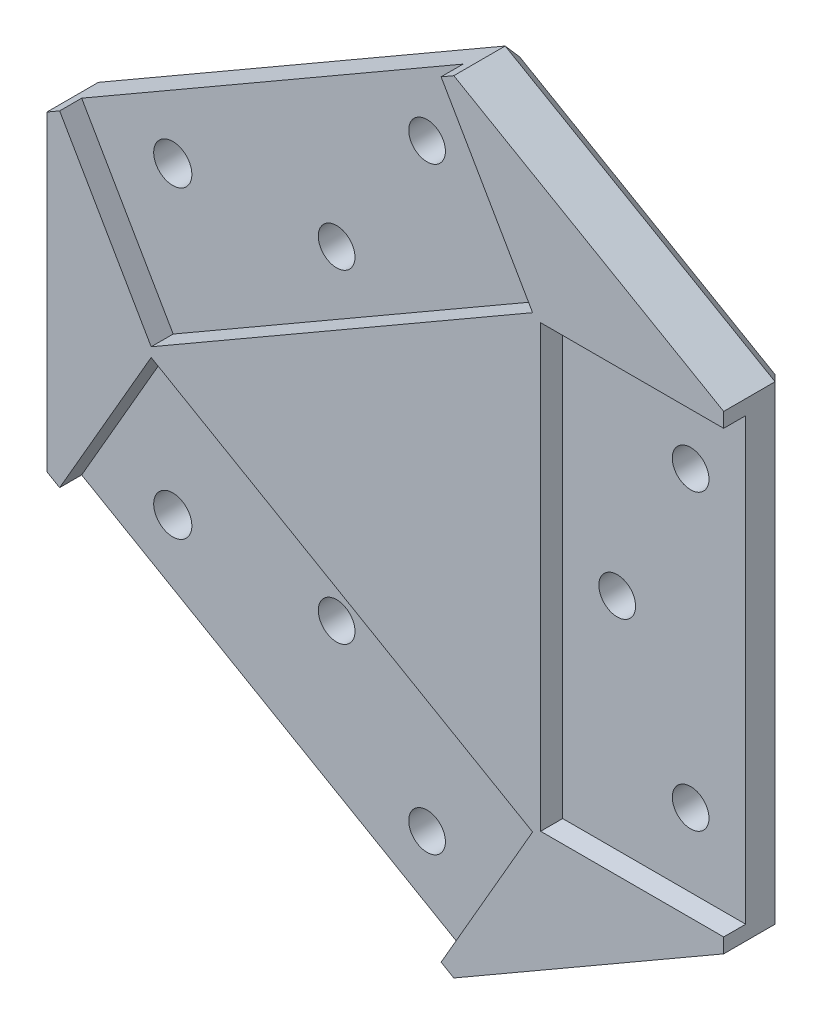
ISO-10303-21;
HEADER;
FILE_DESCRIPTION(('STEP AP214'),'2;1');
FILE_NAME('part.step','',(''),(''),'','','');
FILE_SCHEMA(('AUTOMOTIVE_DESIGN { 1 0 10303 214 1 1 1 1 }'));
ENDSEC;
DATA;
#1=APPLICATION_CONTEXT('core data for automotive mechanical design processes');
#2=APPLICATION_PROTOCOL_DEFINITION('international standard','automotive_design',2000,#1);
#3=PRODUCT_CONTEXT('',#1,'mechanical');
#4=PRODUCT('Part','Part','',(#3));
#5=PRODUCT_RELATED_PRODUCT_CATEGORY('part','',(#4));
#6=PRODUCT_DEFINITION_FORMATION('','',#4);
#7=PRODUCT_DEFINITION_CONTEXT('part definition',#1,'design');
#8=PRODUCT_DEFINITION('design','',#6,#7);
#9=PRODUCT_DEFINITION_SHAPE('','',#8);
#10=(LENGTH_UNIT() NAMED_UNIT(*) SI_UNIT(.MILLI.,.METRE.));
#11=(NAMED_UNIT(*) PLANE_ANGLE_UNIT() SI_UNIT($,.RADIAN.));
#12=(NAMED_UNIT(*) SI_UNIT($,.STERADIAN.) SOLID_ANGLE_UNIT());
#13=UNCERTAINTY_MEASURE_WITH_UNIT(LENGTH_MEASURE(1.E-05),#10,'distance_accuracy_value','');
#14=(GEOMETRIC_REPRESENTATION_CONTEXT(3) GLOBAL_UNCERTAINTY_ASSIGNED_CONTEXT((#13)) GLOBAL_UNIT_ASSIGNED_CONTEXT((#10,
#11,#12)) REPRESENTATION_CONTEXT('',''));
#15=CARTESIAN_POINT('',(0.,0.,0.));
#16=DIRECTION('',(0.,0.,1.));
#17=DIRECTION('',(1.,0.,0.));
#18=AXIS2_PLACEMENT_3D('',#15,#16,#17);
#19=CARTESIAN_POINT('',(2947.32445816177,821.633970520582,9.));
#20=DIRECTION('',(0.,0.,1.));
#21=DIRECTION('',(1.,0.,0.));
#22=AXIS2_PLACEMENT_3D('',#19,#20,#21);
#23=PLANE('',#22);
#24=DIRECTION('',(0.,-1.,0.));
#25=VECTOR('',#24,1.);
#26=CARTESIAN_POINT('',(2968.48484208918,821.633970520582,9.));
#27=LINE('',#26,#25);
#28=CARTESIAN_POINT('',(2968.48484208918,961.308381014684,9.));
#29=VERTEX_POINT('',#28);
#30=CARTESIAN_POINT('',(2968.48484208918,901.308381014683,9.));
#31=VERTEX_POINT('',#30);
#32=EDGE_CURVE('E217',#29,#31,#27,.T.);
#33=ORIENTED_EDGE('',*,*,#32,.F.);
#34=DIRECTION('',(1.,0.,0.));
#35=VECTOR('',#34,1.);
#36=CARTESIAN_POINT('',(2947.32445816177,961.308381014684,9.));
#37=LINE('',#36,#35);
#38=CARTESIAN_POINT('',(2993.41893222177,961.308381014684,9.));
#39=VERTEX_POINT('',#38);
#40=EDGE_CURVE('E187',#29,#39,#37,.T.);
#41=ORIENTED_EDGE('',*,*,#40,.T.);
#42=DIRECTION('',(0.,-1.,0.));
#43=VECTOR('',#42,1.);
#44=CARTESIAN_POINT('',(2993.41893222177,821.633970520584,9.));
#45=LINE('',#44,#43);
#46=CARTESIAN_POINT('',(2993.41893222177,963.308381014684,9.));
#47=VERTEX_POINT('',#46);
#48=EDGE_CURVE('E299',#47,#39,#45,.T.);
#49=ORIENTED_EDGE('',*,*,#48,.F.);
#50=DIRECTION('',(0.866025403784424,-0.500000000000026,0.));
#51=VECTOR('',#50,1.);
#52=CARTESIAN_POINT('',(3020.19489595381,947.849271146175,9.));
#53=LINE('',#52,#51);
#54=CARTESIAN_POINT('',(2956.65560994398,984.533695028071,9.));
#55=VERTEX_POINT('',#54);
#56=EDGE_CURVE('E302',#55,#47,#53,.T.);
#57=ORIENTED_EDGE('',*,*,#56,.F.);
#58=DIRECTION('',(0.866025403784453,0.499999999999975,0.));
#59=VECTOR('',#58,1.);
#60=CARTESIAN_POINT('',(2879.11959626084,939.768256656223,9.));
#61=LINE('',#60,#59);
#62=CARTESIAN_POINT('',(2954.92355913641,983.533695028071,9.));
#63=VERTEX_POINT('',#62);
#64=EDGE_CURVE('E306',#63,#55,#61,.T.);
#65=ORIENTED_EDGE('',*,*,#64,.F.);
#66=DIRECTION('',(-0.499999999999997,0.866025403784441,0.));
#67=VECTOR('',#66,1.);
#68=CARTESIAN_POINT('',(3023.12842103735,865.399408892434,9.));
#69=LINE('',#68,#67);
#70=CARTESIAN_POINT('',(2967.39060420271,961.940139552993,9.));
#71=VERTEX_POINT('',#70);
#72=EDGE_CURVE('E248',#71,#63,#69,.T.);
#73=ORIENTED_EDGE('',*,*,#72,.F.);
#74=DIRECTION('',(-0.866025403784429,-0.500000000000017,0.));
#75=VECTOR('',#74,1.);
#76=CARTESIAN_POINT('',(2891.58664132714,918.174701181138,9.));
#77=LINE('',#76,#75);
#78=CARTESIAN_POINT('',(2915.42907997564,931.940139552992,9.));
#79=VERTEX_POINT('',#78);
#80=EDGE_CURVE('E222',#71,#79,#77,.T.);
#81=ORIENTED_EDGE('',*,*,#80,.T.);
#82=DIRECTION('',(-0.50000000000001,0.866025403784433,0.));
#83=VECTOR('',#82,1.);
#84=CARTESIAN_POINT('',(2971.16689681028,835.399408892435,9.));
#85=LINE('',#84,#83);
#86=CARTESIAN_POINT('',(2902.96203490935,953.533695028073,9.));
#87=VERTEX_POINT('',#86);
#88=EDGE_CURVE('E231',#79,#87,#85,.T.);
#89=ORIENTED_EDGE('',*,*,#88,.T.);
#90=CARTESIAN_POINT('',(2901.22998410178,952.533695028074,9.));
#91=VERTEX_POINT('',#90);
#92=EDGE_CURVE('E307',#91,#87,#61,.T.);
#93=ORIENTED_EDGE('',*,*,#92,.F.);
#94=DIRECTION('',(0.,1.,0.));
#95=VECTOR('',#94,1.);
#96=CARTESIAN_POINT('',(2901.22998410177,821.633970520584,9.));
#97=LINE('',#96,#95);
#98=CARTESIAN_POINT('',(2901.22998410178,910.083067001311,9.));
#99=VERTEX_POINT('',#98);
#100=EDGE_CURVE('E310',#99,#91,#97,.T.);
#101=ORIENTED_EDGE('',*,*,#100,.F.);
#102=DIRECTION('',(0.866025403784218,-0.500000000000382,0.));
#103=VECTOR('',#102,1.);
#104=CARTESIAN_POINT('',(2974.10042189382,868.011300126065,9.));
#105=LINE('',#104,#103);
#106=CARTESIAN_POINT('',(2902.96203490935,909.083067001307,9.));
#107=VERTEX_POINT('',#106);
#108=EDGE_CURVE('E314',#99,#107,#105,.T.);
#109=ORIENTED_EDGE('',*,*,#108,.T.);
#110=DIRECTION('',(-0.500000000000018,-0.866025403784428,0.));
#111=VECTOR('',#110,1.);
#112=CARTESIAN_POINT('',(2876.18607117731,862.705737395783,9.));
#113=LINE('',#112,#111);
#114=CARTESIAN_POINT('',(2915.42907997564,930.676622476375,9.));
#115=VERTEX_POINT('',#114);
#116=EDGE_CURVE('E285',#115,#107,#113,.T.);
#117=ORIENTED_EDGE('',*,*,#116,.F.);
#118=DIRECTION('',(-0.866025403784444,0.499999999999991,0.));
#119=VECTOR('',#118,1.);
#120=CARTESIAN_POINT('',(2986.56746696011,889.604855601177,9.));
#121=LINE('',#120,#119);
#122=CARTESIAN_POINT('',(2967.39060420271,900.676622476375,9.));
#123=VERTEX_POINT('',#122);
#124=EDGE_CURVE('E255',#123,#115,#121,.T.);
#125=ORIENTED_EDGE('',*,*,#124,.F.);
#126=DIRECTION('',(-0.499999999999998,-0.86602540378444,0.));
#127=VECTOR('',#126,1.);
#128=CARTESIAN_POINT('',(2928.14759540437,832.70573739578,9.));
#129=LINE('',#128,#127);
#130=CARTESIAN_POINT('',(2954.92355913641,879.083067001283,9.));
#131=VERTEX_POINT('',#130);
#132=EDGE_CURVE('E266',#123,#131,#129,.T.);
#133=ORIENTED_EDGE('',*,*,#132,.T.);
#134=CARTESIAN_POINT('',(2956.65560994397,878.083067001287,9.));
#135=VERTEX_POINT('',#134);
#136=EDGE_CURVE('E313',#131,#135,#105,.T.);
#137=ORIENTED_EDGE('',*,*,#136,.T.);
#138=DIRECTION('',(0.866025403784429,0.500000000000018,0.));
#139=VECTOR('',#138,1.);
#140=CARTESIAN_POINT('',(2925.21407032084,859.930285636136,9.));
#141=LINE('',#140,#139);
#142=CARTESIAN_POINT('',(2993.41893222177,899.308381014684,9.));
#143=VERTEX_POINT('',#142);
#144=EDGE_CURVE('E317',#135,#143,#141,.T.);
#145=ORIENTED_EDGE('',*,*,#144,.T.);
#146=CARTESIAN_POINT('',(2993.41893222177,901.308381014683,9.));
#147=VERTEX_POINT('',#146);
#148=EDGE_CURVE('E303',#147,#143,#45,.T.);
#149=ORIENTED_EDGE('',*,*,#148,.F.);
#150=DIRECTION('',(1.,0.,0.));
#151=VECTOR('',#150,1.);
#152=CARTESIAN_POINT('',(2947.32445816177,901.308381014683,9.));
#153=LINE('',#152,#151);
#154=EDGE_CURVE('E201',#31,#147,#153,.T.);
#155=ORIENTED_EDGE('',*,*,#154,.F.);
#156=EDGE_LOOP('',(#33,#41,#49,#57,#65,#73,#81,#89,#93,#101,#109,#117,#125,#133,#137,#145,#149,#155));
#157=FACE_BOUND('',#156,.T.);
#158=ADVANCED_FACE('F35',(#157),#23,.T.);
#159=CARTESIAN_POINT('',(2993.41893222177,821.633970520584,9.));
#160=DIRECTION('',(1.,0.,0.));
#161=DIRECTION('',(0.,1.,0.));
#162=AXIS2_PLACEMENT_3D('',#159,#160,#161);
#163=PLANE('',#162);
#164=ORIENTED_EDGE('',*,*,#48,.T.);
#165=DIRECTION('',(0.,0.,1.));
#166=VECTOR('',#165,1.);
#167=CARTESIAN_POINT('',(2993.41893222177,961.308381014684,6.));
#168=LINE('',#167,#166);
#169=CARTESIAN_POINT('',(2993.41893222177,961.308381014684,6.));
#170=VERTEX_POINT('',#169);
#171=EDGE_CURVE('E220',#170,#39,#168,.T.);
#172=ORIENTED_EDGE('',*,*,#171,.F.);
#173=DIRECTION('',(0.,1.,0.));
#174=VECTOR('',#173,1.);
#175=CARTESIAN_POINT('',(2993.41893222177,821.633970520583,6.));
#176=LINE('',#175,#174);
#177=CARTESIAN_POINT('',(2993.41893222177,901.308381014683,6.));
#178=VERTEX_POINT('',#177);
#179=EDGE_CURVE('E199',#178,#170,#176,.T.);
#180=ORIENTED_EDGE('',*,*,#179,.F.);
#181=DIRECTION('',(0.,0.,1.));
#182=VECTOR('',#181,1.);
#183=CARTESIAN_POINT('',(2993.41893222177,901.308381014683,6.));
#184=LINE('',#183,#182);
#185=EDGE_CURVE('E223',#178,#147,#184,.T.);
#186=ORIENTED_EDGE('',*,*,#185,.T.);
#187=ORIENTED_EDGE('',*,*,#148,.T.);
#188=DIRECTION('',(0.,0.,-1.));
#189=VECTOR('',#188,1.);
#190=CARTESIAN_POINT('',(2993.41893222177,899.308381014684,9.));
#191=LINE('',#190,#189);
#192=CARTESIAN_POINT('',(2993.41893222177,899.308381014684,2.00000000000003));
#193=VERTEX_POINT('',#192);
#194=EDGE_CURVE('E320',#143,#193,#191,.T.);
#195=ORIENTED_EDGE('',*,*,#194,.T.);
#196=DIRECTION('',(0.,1.,0.));
#197=VECTOR('',#196,1.);
#198=CARTESIAN_POINT('',(2993.41893222177,963.308381014684,2.00000000000003));
#199=LINE('',#198,#197);
#200=CARTESIAN_POINT('',(2993.41893222177,963.308381014684,2.00000000000003));
#201=VERTEX_POINT('',#200);
#202=EDGE_CURVE('E11',#193,#201,#199,.T.);
#203=ORIENTED_EDGE('',*,*,#202,.T.);
#204=DIRECTION('',(0.,0.,-1.));
#205=VECTOR('',#204,1.);
#206=CARTESIAN_POINT('',(2993.41893222177,963.308381014684,9.));
#207=LINE('',#206,#205);
#208=EDGE_CURVE('E362',#47,#201,#207,.T.);
#209=ORIENTED_EDGE('',*,*,#208,.F.);
#210=EDGE_LOOP('',(#164,#172,#180,#186,#187,#195,#203,#209));
#211=FACE_BOUND('',#210,.T.);
#212=ADVANCED_FACE('F476',(#211),#163,.T.);
#213=CARTESIAN_POINT('',(2985.91893222177,951.308381014684,9.));
#214=DIRECTION('',(0.,0.,-1.));
#215=DIRECTION('',(-1.,0.,0.));
#216=AXIS2_PLACEMENT_3D('',#213,#214,#215);
#217=CYLINDRICAL_SURFACE('',#216,2.49999999999995);
#218=CARTESIAN_POINT('',(2985.91893222177,951.308381014684,0.));
#219=DIRECTION('',(0.,0.,1.));
#220=DIRECTION('',(1.,0.,0.));
#221=AXIS2_PLACEMENT_3D('',#218,#219,#220);
#222=CIRCLE('',#221,2.49999999999995);
#223=CARTESIAN_POINT('',(2988.41893222177,951.308381014684,0.));
#224=VERTEX_POINT('',#223);
#225=EDGE_CURVE('E333',#224,#224,#222,.T.);
#226=ORIENTED_EDGE('',*,*,#225,.F.);
#227=EDGE_LOOP('',(#226));
#228=FACE_BOUND('',#227,.T.);
#229=CARTESIAN_POINT('',(2985.91893222177,951.308381014684,6.));
#230=DIRECTION('',(0.,0.,1.));
#231=DIRECTION('',(1.,0.,0.));
#232=AXIS2_PLACEMENT_3D('',#229,#230,#231);
#233=CIRCLE('',#232,2.49999999999995);
#234=CARTESIAN_POINT('',(2988.41893222177,951.308381014684,6.));
#235=VERTEX_POINT('',#234);
#236=EDGE_CURVE('E208',#235,#235,#233,.F.);
#237=ORIENTED_EDGE('',*,*,#236,.F.);
#238=EDGE_LOOP('',(#237));
#239=FACE_BOUND('',#238,.T.);
#240=ADVANCED_FACE('F481',(#228,#239),#217,.F.);
#241=CARTESIAN_POINT('',(2985.91893222177,911.308381014684,9.));
#242=DIRECTION('',(0.,0.,-1.));
#243=DIRECTION('',(-1.,0.,0.));
#244=AXIS2_PLACEMENT_3D('',#241,#242,#243);
#245=CYLINDRICAL_SURFACE('',#244,2.49999999999995);
#246=CARTESIAN_POINT('',(2985.91893222177,911.308381014684,0.));
#247=DIRECTION('',(0.,0.,1.));
#248=DIRECTION('',(1.,0.,0.));
#249=AXIS2_PLACEMENT_3D('',#246,#247,#248);
#250=CIRCLE('',#249,2.49999999999995);
#251=CARTESIAN_POINT('',(2988.41893222177,911.308381014684,0.));
#252=VERTEX_POINT('',#251);
#253=EDGE_CURVE('E330',#252,#252,#250,.T.);
#254=ORIENTED_EDGE('',*,*,#253,.F.);
#255=EDGE_LOOP('',(#254));
#256=FACE_BOUND('',#255,.T.);
#257=CARTESIAN_POINT('',(2985.91893222177,911.308381014684,6.));
#258=DIRECTION('',(0.,0.,1.));
#259=DIRECTION('',(1.,0.,0.));
#260=AXIS2_PLACEMENT_3D('',#257,#258,#259);
#261=CIRCLE('',#260,2.49999999999995);
#262=CARTESIAN_POINT('',(2988.41893222177,911.308381014684,6.));
#263=VERTEX_POINT('',#262);
#264=EDGE_CURVE('E193',#263,#263,#261,.F.);
#265=ORIENTED_EDGE('',*,*,#264,.F.);
#266=EDGE_LOOP('',(#265));
#267=FACE_BOUND('',#266,.T.);
#268=ADVANCED_FACE('F493',(#256,#267),#245,.F.);
#269=CARTESIAN_POINT('',(2975.91893222177,931.308381014684,9.));
#270=DIRECTION('',(0.,0.,-1.));
#271=DIRECTION('',(-1.,0.,0.));
#272=AXIS2_PLACEMENT_3D('',#269,#270,#271);
#273=CYLINDRICAL_SURFACE('',#272,2.49999999999995);
#274=CARTESIAN_POINT('',(2975.91893222177,931.308381014684,0.));
#275=DIRECTION('',(0.,0.,1.));
#276=DIRECTION('',(1.,0.,0.));
#277=AXIS2_PLACEMENT_3D('',#274,#275,#276);
#278=CIRCLE('',#277,2.49999999999995);
#279=CARTESIAN_POINT('',(2978.41893222177,931.308381014684,0.));
#280=VERTEX_POINT('',#279);
#281=EDGE_CURVE('E345',#280,#280,#278,.T.);
#282=ORIENTED_EDGE('',*,*,#281,.F.);
#283=EDGE_LOOP('',(#282));
#284=FACE_BOUND('',#283,.T.);
#285=CARTESIAN_POINT('',(2975.91893222177,931.308381014684,6.));
#286=DIRECTION('',(0.,0.,1.));
#287=DIRECTION('',(1.,0.,0.));
#288=AXIS2_PLACEMENT_3D('',#285,#286,#287);
#289=CIRCLE('',#288,2.49999999999995);
#290=CARTESIAN_POINT('',(2978.41893222177,931.308381014684,6.));
#291=VERTEX_POINT('',#290);
#292=EDGE_CURVE('E211',#291,#291,#289,.F.);
#293=ORIENTED_EDGE('',*,*,#292,.F.);
#294=EDGE_LOOP('',(#293));
#295=FACE_BOUND('',#294,.T.);
#296=ADVANCED_FACE('F490',(#284,#295),#273,.F.);
#297=CARTESIAN_POINT('',(2879.11959626084,939.768256656223,9.));
#298=DIRECTION('',(-0.499999999999975,0.866025403784453,0.));
#299=DIRECTION('',(-0.866025403784453,-0.499999999999975,0.));
#300=AXIS2_PLACEMENT_3D('',#297,#298,#299);
#301=PLANE('',#300);
#302=ORIENTED_EDGE('',*,*,#92,.T.);
#303=DIRECTION('',(0.,0.,1.));
#304=VECTOR('',#303,1.);
#305=CARTESIAN_POINT('',(2902.96203490935,953.533695028073,6.));
#306=LINE('',#305,#304);
#307=CARTESIAN_POINT('',(2902.96203490935,953.533695028073,6.));
#308=VERTEX_POINT('',#307);
#309=EDGE_CURVE('E256',#308,#87,#306,.T.);
#310=ORIENTED_EDGE('',*,*,#309,.F.);
#311=DIRECTION('',(-0.866025403784453,-0.499999999999975,0.));
#312=VECTOR('',#311,1.);
#313=CARTESIAN_POINT('',(2879.11959626084,939.768256656223,6.));
#314=LINE('',#313,#312);
#315=CARTESIAN_POINT('',(2954.92355913641,983.533695028071,6.));
#316=VERTEX_POINT('',#315);
#317=EDGE_CURVE('E241',#316,#308,#314,.T.);
#318=ORIENTED_EDGE('',*,*,#317,.F.);
#319=DIRECTION('',(0.,0.,1.));
#320=VECTOR('',#319,1.);
#321=CARTESIAN_POINT('',(2954.92355913641,983.533695028071,6.));
#322=LINE('',#321,#320);
#323=EDGE_CURVE('E258',#316,#63,#322,.T.);
#324=ORIENTED_EDGE('',*,*,#323,.T.);
#325=ORIENTED_EDGE('',*,*,#64,.T.);
#326=DIRECTION('',(0.,0.,-1.));
#327=VECTOR('',#326,1.);
#328=CARTESIAN_POINT('',(2956.65560994398,984.533695028071,9.));
#329=LINE('',#328,#327);
#330=CARTESIAN_POINT('',(2956.65560994398,984.533695028071,2.00000000000003));
#331=VERTEX_POINT('',#330);
#332=EDGE_CURVE('E359',#55,#331,#329,.T.);
#333=ORIENTED_EDGE('',*,*,#332,.T.);
#334=DIRECTION('',(-0.866025403784453,-0.499999999999975,0.));
#335=VECTOR('',#334,1.);
#336=CARTESIAN_POINT('',(2901.22998410178,952.533695028074,2.00000000000003));
#337=LINE('',#336,#335);
#338=CARTESIAN_POINT('',(2901.22998410178,952.533695028074,2.00000000000003));
#339=VERTEX_POINT('',#338);
#340=EDGE_CURVE('E381',#331,#339,#337,.T.);
#341=ORIENTED_EDGE('',*,*,#340,.T.);
#342=DIRECTION('',(0.,0.,-1.));
#343=VECTOR('',#342,1.);
#344=CARTESIAN_POINT('',(2901.22998410178,952.533695028074,9.));
#345=LINE('',#344,#343);
#346=EDGE_CURVE('E356',#91,#339,#345,.T.);
#347=ORIENTED_EDGE('',*,*,#346,.F.);
#348=EDGE_LOOP('',(#302,#310,#318,#324,#325,#333,#341,#347));
#349=FACE_BOUND('',#348,.T.);
#350=ADVANCED_FACE('F443',(#349),#301,.T.);
#351=CARTESIAN_POINT('',(2950.01330509856,972.038504499697,9.));
#352=DIRECTION('',(0.,0.,-1.));
#353=DIRECTION('',(-1.,0.,0.));
#354=AXIS2_PLACEMENT_3D('',#351,#352,#353);
#355=CYLINDRICAL_SURFACE('',#354,2.49999999999995);
#356=CARTESIAN_POINT('',(2950.01330509856,972.038504499697,0.));
#357=DIRECTION('',(0.,0.,1.));
#358=DIRECTION('',(1.,0.,0.));
#359=AXIS2_PLACEMENT_3D('',#356,#357,#358);
#360=CIRCLE('',#359,2.49999999999995);
#361=CARTESIAN_POINT('',(2952.51330509856,972.038504499697,0.));
#362=VERTEX_POINT('',#361);
#363=EDGE_CURVE('E342',#362,#362,#360,.T.);
#364=ORIENTED_EDGE('',*,*,#363,.F.);
#365=EDGE_LOOP('',(#364));
#366=FACE_BOUND('',#365,.T.);
#367=CARTESIAN_POINT('',(2950.01330509856,972.038504499697,6.));
#368=DIRECTION('',(0.,0.,1.));
#369=DIRECTION('',(1.,0.,0.));
#370=AXIS2_PLACEMENT_3D('',#367,#368,#369);
#371=CIRCLE('',#370,2.49999999999995);
#372=CARTESIAN_POINT('',(2952.51330509856,972.038504499697,6.));
#373=VERTEX_POINT('',#372);
#374=EDGE_CURVE('E230',#373,#373,#371,.F.);
#375=ORIENTED_EDGE('',*,*,#374,.F.);
#376=EDGE_LOOP('',(#375));
#377=FACE_BOUND('',#376,.T.);
#378=ADVANCED_FACE('F495',(#366,#377),#355,.F.);
#379=CARTESIAN_POINT('',(2915.37228894719,952.038504499697,9.));
#380=DIRECTION('',(0.,0.,-1.));
#381=DIRECTION('',(-1.,0.,0.));
#382=AXIS2_PLACEMENT_3D('',#379,#380,#381);
#383=CYLINDRICAL_SURFACE('',#382,2.60000000000016);
#384=CARTESIAN_POINT('',(2915.37228894719,952.038504499697,0.));
#385=DIRECTION('',(0.,0.,1.));
#386=DIRECTION('',(1.,0.,0.));
#387=AXIS2_PLACEMENT_3D('',#384,#385,#386);
#388=CIRCLE('',#387,2.60000000000016);
#389=CARTESIAN_POINT('',(2917.97228894719,952.038504499697,0.));
#390=VERTEX_POINT('',#389);
#391=EDGE_CURVE('E339',#390,#390,#388,.T.);
#392=ORIENTED_EDGE('',*,*,#391,.F.);
#393=EDGE_LOOP('',(#392));
#394=FACE_BOUND('',#393,.T.);
#395=CARTESIAN_POINT('',(2915.37228894719,952.038504499697,6.));
#396=DIRECTION('',(0.,0.,1.));
#397=DIRECTION('',(1.,0.,0.));
#398=AXIS2_PLACEMENT_3D('',#395,#396,#397);
#399=CIRCLE('',#398,2.60000000000016);
#400=CARTESIAN_POINT('',(2917.97228894719,952.038504499697,6.));
#401=VERTEX_POINT('',#400);
#402=EDGE_CURVE('E234',#401,#401,#399,.F.);
#403=ORIENTED_EDGE('',*,*,#402,.F.);
#404=EDGE_LOOP('',(#403));
#405=FACE_BOUND('',#404,.T.);
#406=ADVANCED_FACE('F498',(#394,#405),#383,.F.);
#407=CARTESIAN_POINT('',(2937.69279702287,953.378250461853,9.));
#408=DIRECTION('',(0.,0.,-1.));
#409=DIRECTION('',(-1.,0.,0.));
#410=AXIS2_PLACEMENT_3D('',#407,#408,#409);
#411=CYLINDRICAL_SURFACE('',#410,2.49999999999995);
#412=CARTESIAN_POINT('',(2937.69279702287,953.378250461853,0.));
#413=DIRECTION('',(0.,0.,1.));
#414=DIRECTION('',(1.,0.,0.));
#415=AXIS2_PLACEMENT_3D('',#412,#413,#414);
#416=CIRCLE('',#415,2.49999999999995);
#417=CARTESIAN_POINT('',(2940.19279702287,953.378250461853,0.));
#418=VERTEX_POINT('',#417);
#419=EDGE_CURVE('E336',#418,#418,#416,.T.);
#420=ORIENTED_EDGE('',*,*,#419,.F.);
#421=EDGE_LOOP('',(#420));
#422=FACE_BOUND('',#421,.T.);
#423=CARTESIAN_POINT('',(2937.69279702287,953.378250461853,6.));
#424=DIRECTION('',(0.,0.,1.));
#425=DIRECTION('',(1.,0.,0.));
#426=AXIS2_PLACEMENT_3D('',#423,#424,#425);
#427=CIRCLE('',#426,2.49999999999995);
#428=CARTESIAN_POINT('',(2940.19279702287,953.378250461853,6.));
#429=VERTEX_POINT('',#428);
#430=EDGE_CURVE('E227',#429,#429,#427,.F.);
#431=ORIENTED_EDGE('',*,*,#430,.F.);
#432=EDGE_LOOP('',(#431));
#433=FACE_BOUND('',#432,.T.);
#434=ADVANCED_FACE('F502',(#422,#433),#411,.F.);
#435=CARTESIAN_POINT('',(2974.10042189382,868.011300126065,9.));
#436=DIRECTION('',(0.500000000000382,0.866025403784218,0.));
#437=DIRECTION('',(-0.866025403784218,0.500000000000382,0.));
#438=AXIS2_PLACEMENT_3D('',#435,#436,#437);
#439=PLANE('',#438);
#440=DIRECTION('',(0.,0.,1.));
#441=VECTOR('',#440,1.);
#442=CARTESIAN_POINT('',(2954.92355913641,879.083067001283,6.));
#443=LINE('',#442,#441);
#444=CARTESIAN_POINT('',(2954.92355913641,879.083067001283,6.));
#445=VERTEX_POINT('',#444);
#446=EDGE_CURVE('E292',#445,#131,#443,.T.);
#447=ORIENTED_EDGE('',*,*,#446,.F.);
#448=DIRECTION('',(0.866025403784218,-0.500000000000382,0.));
#449=VECTOR('',#448,1.);
#450=CARTESIAN_POINT('',(2974.10042189382,868.011300126065,6.));
#451=LINE('',#450,#449);
#452=CARTESIAN_POINT('',(2902.96203490935,909.083067001307,6.));
#453=VERTEX_POINT('',#452);
#454=EDGE_CURVE('E278',#453,#445,#451,.T.);
#455=ORIENTED_EDGE('',*,*,#454,.F.);
#456=DIRECTION('',(0.,0.,1.));
#457=VECTOR('',#456,1.);
#458=CARTESIAN_POINT('',(2902.96203490935,909.083067001307,6.));
#459=LINE('',#458,#457);
#460=EDGE_CURVE('E294',#453,#107,#459,.T.);
#461=ORIENTED_EDGE('',*,*,#460,.T.);
#462=ORIENTED_EDGE('',*,*,#108,.F.);
#463=DIRECTION('',(0.,0.,-1.));
#464=VECTOR('',#463,1.);
#465=CARTESIAN_POINT('',(2901.22998410178,910.083067001311,9.));
#466=LINE('',#465,#464);
#467=CARTESIAN_POINT('',(2901.22998410178,910.083067001311,2.00000000000003));
#468=VERTEX_POINT('',#467);
#469=EDGE_CURVE('E353',#99,#468,#466,.T.);
#470=ORIENTED_EDGE('',*,*,#469,.T.);
#471=DIRECTION('',(0.866025403784218,-0.500000000000382,0.));
#472=VECTOR('',#471,1.);
#473=CARTESIAN_POINT('',(2974.10042189382,868.011300126065,2.00000000000003));
#474=LINE('',#473,#472);
#475=CARTESIAN_POINT('',(2956.65560994397,878.083067001287,2.00000000000003));
#476=VERTEX_POINT('',#475);
#477=EDGE_CURVE('E385',#468,#476,#474,.T.);
#478=ORIENTED_EDGE('',*,*,#477,.T.);
#479=DIRECTION('',(0.,0.,-1.));
#480=VECTOR('',#479,1.);
#481=CARTESIAN_POINT('',(2956.65560994397,878.083067001287,9.));
#482=LINE('',#481,#480);
#483=EDGE_CURVE('E350',#135,#476,#482,.T.);
#484=ORIENTED_EDGE('',*,*,#483,.F.);
#485=ORIENTED_EDGE('',*,*,#136,.F.);
#486=EDGE_LOOP('',(#447,#455,#461,#462,#470,#478,#484,#485));
#487=FACE_BOUND('',#486,.T.);
#488=ADVANCED_FACE('F415',(#487),#439,.F.);
#489=CARTESIAN_POINT('',(2950.01330509856,890.57825752967,9.));
#490=DIRECTION('',(0.,0.,-1.));
#491=DIRECTION('',(-1.,0.,0.));
#492=AXIS2_PLACEMENT_3D('',#489,#490,#491);
#493=CYLINDRICAL_SURFACE('',#492,2.49999999999995);
#494=CARTESIAN_POINT('',(2950.01330509856,890.57825752967,0.));
#495=DIRECTION('',(0.,0.,1.));
#496=DIRECTION('',(1.,0.,0.));
#497=AXIS2_PLACEMENT_3D('',#494,#495,#496);
#498=CIRCLE('',#497,2.49999999999995);
#499=CARTESIAN_POINT('',(2952.51330509856,890.57825752967,0.));
#500=VERTEX_POINT('',#499);
#501=EDGE_CURVE('E327',#500,#500,#498,.T.);
#502=ORIENTED_EDGE('',*,*,#501,.F.);
#503=EDGE_LOOP('',(#502));
#504=FACE_BOUND('',#503,.T.);
#505=CARTESIAN_POINT('',(2950.01330509856,890.57825752967,6.));
#506=DIRECTION('',(0.,0.,1.));
#507=DIRECTION('',(1.,0.,0.));
#508=AXIS2_PLACEMENT_3D('',#505,#506,#507);
#509=CIRCLE('',#508,2.49999999999995);
#510=CARTESIAN_POINT('',(2952.51330509856,890.57825752967,6.));
#511=VERTEX_POINT('',#510);
#512=EDGE_CURVE('E265',#511,#511,#509,.F.);
#513=ORIENTED_EDGE('',*,*,#512,.F.);
#514=EDGE_LOOP('',(#513));
#515=FACE_BOUND('',#514,.T.);
#516=ADVANCED_FACE('F513',(#504,#515),#493,.F.);
#517=CARTESIAN_POINT('',(2915.37228894719,910.57825752967,9.));
#518=DIRECTION('',(0.,0.,-1.));
#519=DIRECTION('',(-1.,0.,0.));
#520=AXIS2_PLACEMENT_3D('',#517,#518,#519);
#521=CYLINDRICAL_SURFACE('',#520,2.60000000000016);
#522=CARTESIAN_POINT('',(2915.37228894719,910.57825752967,0.));
#523=DIRECTION('',(0.,0.,1.));
#524=DIRECTION('',(1.,0.,0.));
#525=AXIS2_PLACEMENT_3D('',#522,#523,#524);
#526=CIRCLE('',#525,2.60000000000016);
#527=CARTESIAN_POINT('',(2917.97228894719,910.57825752967,0.));
#528=VERTEX_POINT('',#527);
#529=EDGE_CURVE('E324',#528,#528,#526,.T.);
#530=ORIENTED_EDGE('',*,*,#529,.F.);
#531=EDGE_LOOP('',(#530));
#532=FACE_BOUND('',#531,.T.);
#533=CARTESIAN_POINT('',(2915.37228894719,910.57825752967,6.));
#534=DIRECTION('',(0.,0.,1.));
#535=DIRECTION('',(1.,0.,0.));
#536=AXIS2_PLACEMENT_3D('',#533,#534,#535);
#537=CIRCLE('',#536,2.60000000000016);
#538=CARTESIAN_POINT('',(2917.97228894719,910.57825752967,6.));
#539=VERTEX_POINT('',#538);
#540=EDGE_CURVE('E262',#539,#539,#537,.F.);
#541=ORIENTED_EDGE('',*,*,#540,.F.);
#542=EDGE_LOOP('',(#541));
#543=FACE_BOUND('',#542,.T.);
#544=ADVANCED_FACE('F516',(#532,#543),#521,.F.);
#545=CARTESIAN_POINT('',(2937.69279702287,909.238511567514,9.));
#546=DIRECTION('',(0.,0.,-1.));
#547=DIRECTION('',(-1.,0.,0.));
#548=AXIS2_PLACEMENT_3D('',#545,#546,#547);
#549=CYLINDRICAL_SURFACE('',#548,2.49999999999995);
#550=CARTESIAN_POINT('',(2937.69279702287,909.238511567514,0.));
#551=DIRECTION('',(0.,0.,1.));
#552=DIRECTION('',(1.,0.,0.));
#553=AXIS2_PLACEMENT_3D('',#550,#551,#552);
#554=CIRCLE('',#553,2.49999999999995);
#555=CARTESIAN_POINT('',(2940.19279702287,909.238511567514,0.));
#556=VERTEX_POINT('',#555);
#557=EDGE_CURVE('E321',#556,#556,#554,.T.);
#558=ORIENTED_EDGE('',*,*,#557,.F.);
#559=EDGE_LOOP('',(#558));
#560=FACE_BOUND('',#559,.T.);
#561=CARTESIAN_POINT('',(2937.69279702287,909.238511567514,6.));
#562=DIRECTION('',(0.,0.,1.));
#563=DIRECTION('',(1.,0.,0.));
#564=AXIS2_PLACEMENT_3D('',#561,#562,#563);
#565=CIRCLE('',#564,2.49999999999995);
#566=CARTESIAN_POINT('',(2940.19279702287,909.238511567514,6.));
#567=VERTEX_POINT('',#566);
#568=EDGE_CURVE('E269',#567,#567,#565,.F.);
#569=ORIENTED_EDGE('',*,*,#568,.F.);
#570=EDGE_LOOP('',(#569));
#571=FACE_BOUND('',#570,.T.);
#572=ADVANCED_FACE('F520',(#560,#571),#549,.F.);
#573=CARTESIAN_POINT('',(3020.19489595381,947.849271146175,9.));
#574=DIRECTION('',(0.500000000000026,0.866025403784424,0.));
#575=DIRECTION('',(-0.866025403784424,0.500000000000026,0.));
#576=AXIS2_PLACEMENT_3D('',#573,#574,#575);
#577=PLANE('',#576);
#578=ORIENTED_EDGE('',*,*,#208,.T.);
#579=DIRECTION('',(-0.866025403784424,0.500000000000026,0.));
#580=VECTOR('',#579,1.);
#581=CARTESIAN_POINT('',(2956.65560994398,984.533695028071,2.00000000000002));
#582=LINE('',#581,#580);
#583=EDGE_CURVE('E378',#201,#331,#582,.T.);
#584=ORIENTED_EDGE('',*,*,#583,.T.);
#585=ORIENTED_EDGE('',*,*,#332,.F.);
#586=ORIENTED_EDGE('',*,*,#56,.T.);
#587=EDGE_LOOP('',(#578,#584,#585,#586));
#588=FACE_BOUND('',#587,.T.);
#589=ADVANCED_FACE('F454',(#588),#577,.T.);
#590=CARTESIAN_POINT('',(2901.22998410177,821.633970520584,9.));
#591=DIRECTION('',(-1.,0.,0.));
#592=DIRECTION('',(0.,-1.,0.));
#593=AXIS2_PLACEMENT_3D('',#590,#591,#592);
#594=PLANE('',#593);
#595=ORIENTED_EDGE('',*,*,#346,.T.);
#596=DIRECTION('',(0.,-1.,0.));
#597=VECTOR('',#596,1.);
#598=CARTESIAN_POINT('',(2901.22998410178,910.083067001311,2.00000000000003));
#599=LINE('',#598,#597);
#600=EDGE_CURVE('E383',#339,#468,#599,.T.);
#601=ORIENTED_EDGE('',*,*,#600,.T.);
#602=ORIENTED_EDGE('',*,*,#469,.F.);
#603=ORIENTED_EDGE('',*,*,#100,.T.);
#604=EDGE_LOOP('',(#595,#601,#602,#603));
#605=FACE_BOUND('',#604,.T.);
#606=ADVANCED_FACE('F441',(#605),#594,.T.);
#607=CARTESIAN_POINT('',(2925.21407032084,859.930285636136,9.));
#608=DIRECTION('',(-0.500000000000017,0.866025403784428,0.));
#609=DIRECTION('',(-0.866025403784429,-0.500000000000018,0.));
#610=AXIS2_PLACEMENT_3D('',#607,#608,#609);
#611=PLANE('',#610);
#612=ORIENTED_EDGE('',*,*,#483,.T.);
#613=DIRECTION('',(0.866025403784429,0.500000000000018,0.));
#614=VECTOR('',#613,1.);
#615=CARTESIAN_POINT('',(2925.21407032084,859.930285636136,2.00000000000003));
#616=LINE('',#615,#614);
#617=EDGE_CURVE('E44',#476,#193,#616,.T.);
#618=ORIENTED_EDGE('',*,*,#617,.T.);
#619=ORIENTED_EDGE('',*,*,#194,.F.);
#620=ORIENTED_EDGE('',*,*,#144,.F.);
#621=EDGE_LOOP('',(#612,#618,#619,#620));
#622=FACE_BOUND('',#621,.T.);
#623=ADVANCED_FACE('F420',(#622),#611,.F.);
#624=CARTESIAN_POINT('',(2947.32445816177,821.633970520582,0.));
#625=DIRECTION('',(0.,0.,1.));
#626=DIRECTION('',(1.,0.,0.));
#627=AXIS2_PLACEMENT_3D('',#624,#625,#626);
#628=PLANE('',#627);
#629=DIRECTION('',(0.866025403784453,0.499999999999975,0.));
#630=VECTOR('',#629,1.);
#631=CARTESIAN_POINT('',(2957.65560994398,982.801644220503,0.));
#632=LINE('',#631,#630);
#633=CARTESIAN_POINT('',(2903.22998410178,951.378994489695,0.));
#634=VERTEX_POINT('',#633);
#635=CARTESIAN_POINT('',(2956.65560994398,982.224293951313,0.));
#636=VERTEX_POINT('',#635);
#637=EDGE_CURVE('E373',#634,#636,#632,.T.);
#638=ORIENTED_EDGE('',*,*,#637,.T.);
#639=DIRECTION('',(0.866025403784424,-0.500000000000026,0.));
#640=VECTOR('',#639,1.);
#641=CARTESIAN_POINT('',(2992.41893222177,961.576330207116,0.));
#642=LINE('',#641,#640);
#643=CARTESIAN_POINT('',(2991.41893222177,962.153680476305,0.));
#644=VERTEX_POINT('',#643);
#645=EDGE_CURVE('E375',#636,#644,#642,.T.);
#646=ORIENTED_EDGE('',*,*,#645,.T.);
#647=DIRECTION('',(0.,-1.,0.));
#648=VECTOR('',#647,1.);
#649=CARTESIAN_POINT('',(2991.41893222177,899.308381014684,0.));
#650=LINE('',#649,#648);
#651=CARTESIAN_POINT('',(2991.41893222177,900.463081553063,0.));
#652=VERTEX_POINT('',#651);
#653=EDGE_CURVE('E365',#644,#652,#650,.T.);
#654=ORIENTED_EDGE('',*,*,#653,.T.);
#655=DIRECTION('',(-0.866025403784429,-0.500000000000018,0.));
#656=VECTOR('',#655,1.);
#657=CARTESIAN_POINT('',(2924.21407032084,861.662336443705,0.));
#658=LINE('',#657,#656);
#659=CARTESIAN_POINT('',(2956.65560994397,880.392468078045,0.));
#660=VERTEX_POINT('',#659);
#661=EDGE_CURVE('E367',#652,#660,#658,.T.);
#662=ORIENTED_EDGE('',*,*,#661,.T.);
#663=DIRECTION('',(-0.866025403784218,0.500000000000382,0.));
#664=VECTOR('',#663,1.);
#665=CARTESIAN_POINT('',(2975.10042189382,869.743350933633,0.));
#666=LINE('',#665,#664);
#667=CARTESIAN_POINT('',(2903.22998410178,911.23776753969,0.));
#668=VERTEX_POINT('',#667);
#669=EDGE_CURVE('E369',#660,#668,#666,.T.);
#670=ORIENTED_EDGE('',*,*,#669,.T.);
#671=DIRECTION('',(0.,1.,0.));
#672=VECTOR('',#671,1.);
#673=CARTESIAN_POINT('',(2903.22998410178,952.533695028074,0.));
#674=LINE('',#673,#672);
#675=EDGE_CURVE('E371',#668,#634,#674,.T.);
#676=ORIENTED_EDGE('',*,*,#675,.T.);
#677=EDGE_LOOP('',(#638,#646,#654,#662,#670,#676));
#678=FACE_BOUND('',#677,.T.);
#679=ORIENTED_EDGE('',*,*,#557,.T.);
#680=EDGE_LOOP('',(#679));
#681=FACE_BOUND('',#680,.T.);
#682=ORIENTED_EDGE('',*,*,#529,.T.);
#683=EDGE_LOOP('',(#682));
#684=FACE_BOUND('',#683,.T.);
#685=ORIENTED_EDGE('',*,*,#501,.T.);
#686=EDGE_LOOP('',(#685));
#687=FACE_BOUND('',#686,.T.);
#688=ORIENTED_EDGE('',*,*,#253,.T.);
#689=EDGE_LOOP('',(#688));
#690=FACE_BOUND('',#689,.T.);
#691=ORIENTED_EDGE('',*,*,#225,.T.);
#692=EDGE_LOOP('',(#691));
#693=FACE_BOUND('',#692,.T.);
#694=ORIENTED_EDGE('',*,*,#419,.T.);
#695=EDGE_LOOP('',(#694));
#696=FACE_BOUND('',#695,.T.);
#697=ORIENTED_EDGE('',*,*,#391,.T.);
#698=EDGE_LOOP('',(#697));
#699=FACE_BOUND('',#698,.T.);
#700=ORIENTED_EDGE('',*,*,#363,.T.);
#701=EDGE_LOOP('',(#700));
#702=FACE_BOUND('',#701,.T.);
#703=ORIENTED_EDGE('',*,*,#281,.T.);
#704=EDGE_LOOP('',(#703));
#705=FACE_BOUND('',#704,.T.);
#706=ADVANCED_FACE('F465',(#678,#681,#684,#687,#690,#693,#696,#699,#702,#705),#628,.F.);
#707=CARTESIAN_POINT('',(2974.10042189382,868.011300126065,2.00000000000003));
#708=DIRECTION('',(0.353553390593554,0.612372435695656,0.707106781186527));
#709=DIRECTION('',(0.,-0.755928946018518,0.654653670707903));
#710=AXIS2_PLACEMENT_3D('',#707,#708,#709);
#711=PLANE('',#710);
#712=DIRECTION('',(2.4133854775802E-13,0.755928946018459,-0.654653670707972));
#713=VECTOR('',#712,1.);
#714=CARTESIAN_POINT('',(2956.65560994396,867.710049078338,10.9832970351851));
#715=LINE('',#714,#713);
#716=EDGE_CURVE('E396',#476,#660,#715,.T.);
#717=ORIENTED_EDGE('',*,*,#716,.F.);
#718=ORIENTED_EDGE('',*,*,#477,.F.);
#719=DIRECTION('',(-0.654653670707985,-0.377964473009077,0.654653670708055));
#720=VECTOR('',#719,1.);
#721=CARTESIAN_POINT('',(2922.05010918521,922.103571822789,-18.820125083438));
#722=LINE('',#721,#720);
#723=EDGE_CURVE('E39',#668,#468,#722,.T.);
#724=ORIENTED_EDGE('',*,*,#723,.F.);
#725=ORIENTED_EDGE('',*,*,#669,.F.);
#726=EDGE_LOOP('',(#717,#718,#724,#725));
#727=FACE_BOUND('',#726,.T.);
#728=ADVANCED_FACE('F37',(#727),#711,.F.);
#729=CARTESIAN_POINT('',(2903.22998410177,821.633970520583,0.));
#730=DIRECTION('',(-0.707106781186592,0.,-0.707106781186503));
#731=DIRECTION('',(-0.707106781186503,0.,0.707106781186592));
#732=AXIS2_PLACEMENT_3D('',#729,#730,#731);
#733=PLANE('',#732);
#734=ORIENTED_EDGE('',*,*,#723,.T.);
#735=ORIENTED_EDGE('',*,*,#600,.F.);
#736=DIRECTION('',(0.654653670707941,-0.377964473009189,-0.654653670708035));
#737=VECTOR('',#736,1.);
#738=CARTESIAN_POINT('',(2935.33355175088,932.843991065541,-32.103567649104));
#739=LINE('',#738,#737);
#740=EDGE_CURVE('E394',#634,#339,#739,.F.);
#741=ORIENTED_EDGE('',*,*,#740,.F.);
#742=ORIENTED_EDGE('',*,*,#675,.F.);
#743=EDGE_LOOP('',(#734,#735,#741,#742));
#744=FACE_BOUND('',#743,.T.);
#745=ADVANCED_FACE('F407',(#744),#733,.T.);
#746=CARTESIAN_POINT('',(2925.21407032084,859.930285636136,2.00000000000003));
#747=DIRECTION('',(-0.353553390593318,0.612372435695843,0.707106781186483));
#748=DIRECTION('',(0.,-0.755928946018399,0.654653670708041));
#749=AXIS2_PLACEMENT_3D('',#746,#747,#748);
#750=PLANE('',#749);
#751=ORIENTED_EDGE('',*,*,#716,.T.);
#752=ORIENTED_EDGE('',*,*,#661,.F.);
#753=DIRECTION('',(0.654653670707964,-0.377964473009152,0.654653670708033));
#754=VECTOR('',#753,1.);
#755=CARTESIAN_POINT('',(3010.92407871087,889.201779976998,19.5051464891049));
#756=LINE('',#755,#754);
#757=EDGE_CURVE('E391',#193,#652,#756,.F.);
#758=ORIENTED_EDGE('',*,*,#757,.F.);
#759=ORIENTED_EDGE('',*,*,#617,.F.);
#760=EDGE_LOOP('',(#751,#752,#758,#759));
#761=FACE_BOUND('',#760,.T.);
#762=ADVANCED_FACE('F467',(#761),#750,.F.);
#763=CARTESIAN_POINT('',(2880.11959626084,938.036205848655,0.));
#764=DIRECTION('',(-0.353553390593288,0.612372435695861,-0.707106781186483));
#765=DIRECTION('',(0.,0.75592894601839,0.654653670708052));
#766=AXIS2_PLACEMENT_3D('',#763,#764,#765);
#767=PLANE('',#766);
#768=ORIENTED_EDGE('',*,*,#740,.T.);
#769=ORIENTED_EDGE('',*,*,#340,.F.);
#770=DIRECTION('',(0.,-0.755928946018395,-0.654653670708045));
#771=VECTOR('',#770,1.);
#772=CARTESIAN_POINT('',(2956.65560994398,956.973957892654,-21.8674324808972));
#773=LINE('',#772,#771);
#774=EDGE_CURVE('E389',#636,#331,#773,.F.);
#775=ORIENTED_EDGE('',*,*,#774,.F.);
#776=ORIENTED_EDGE('',*,*,#637,.F.);
#777=EDGE_LOOP('',(#768,#769,#775,#776));
#778=FACE_BOUND('',#777,.T.);
#779=ADVANCED_FACE('F449',(#778),#767,.T.);
#780=CARTESIAN_POINT('',(2991.41893222177,821.633970520584,0.));
#781=DIRECTION('',(0.707106781186592,0.,-0.707106781186503));
#782=DIRECTION('',(-0.707106781186503,0.,-0.707106781186592));
#783=AXIS2_PLACEMENT_3D('',#780,#781,#782);
#784=PLANE('',#783);
#785=ORIENTED_EDGE('',*,*,#757,.T.);
#786=ORIENTED_EDGE('',*,*,#653,.F.);
#787=DIRECTION('',(0.654653670707947,0.377964473009168,0.654653670708042));
#788=VECTOR('',#787,1.);
#789=CARTESIAN_POINT('',(2956.64932120633,942.079436196924,-34.7696110154461));
#790=LINE('',#789,#788);
#791=EDGE_CURVE('E291',#201,#644,#790,.F.);
#792=ORIENTED_EDGE('',*,*,#791,.F.);
#793=ORIENTED_EDGE('',*,*,#202,.F.);
#794=EDGE_LOOP('',(#785,#786,#792,#793));
#795=FACE_BOUND('',#794,.T.);
#796=ADVANCED_FACE('F462',(#795),#784,.T.);
#797=CARTESIAN_POINT('',(3019.19489595381,946.117220338606,0.));
#798=DIRECTION('',(0.353553390593324,0.61237243569584,-0.707106781186483));
#799=DIRECTION('',(0.,0.755928946018401,0.654653670708039));
#800=AXIS2_PLACEMENT_3D('',#797,#798,#799);
#801=PLANE('',#800);
#802=ORIENTED_EDGE('',*,*,#774,.T.);
#803=ORIENTED_EDGE('',*,*,#583,.F.);
#804=ORIENTED_EDGE('',*,*,#791,.T.);
#805=ORIENTED_EDGE('',*,*,#645,.F.);
#806=EDGE_LOOP('',(#802,#803,#804,#805));
#807=FACE_BOUND('',#806,.T.);
#808=ADVANCED_FACE('F458',(#807),#801,.T.);
#809=CARTESIAN_POINT('',(2986.56746696011,889.604855601177,6.));
#810=DIRECTION('',(0.499999999999991,0.866025403784444,0.));
#811=DIRECTION('',(-0.866025403784444,0.499999999999991,0.));
#812=AXIS2_PLACEMENT_3D('',#809,#810,#811);
#813=PLANE('',#812);
#814=ORIENTED_EDGE('',*,*,#124,.T.);
#815=DIRECTION('',(0.,0.,1.));
#816=VECTOR('',#815,1.);
#817=CARTESIAN_POINT('',(2915.42907997564,930.676622476375,6.));
#818=LINE('',#817,#816);
#819=CARTESIAN_POINT('',(2915.42907997564,930.676622476375,6.));
#820=VERTEX_POINT('',#819);
#821=EDGE_CURVE('E283',#820,#115,#818,.T.);
#822=ORIENTED_EDGE('',*,*,#821,.F.);
#823=DIRECTION('',(-0.866025403784444,0.499999999999991,0.));
#824=VECTOR('',#823,1.);
#825=CARTESIAN_POINT('',(2986.56746696011,889.604855601177,6.));
#826=LINE('',#825,#824);
#827=CARTESIAN_POINT('',(2967.39060420271,900.676622476375,6.));
#828=VERTEX_POINT('',#827);
#829=EDGE_CURVE('E272',#828,#820,#826,.T.);
#830=ORIENTED_EDGE('',*,*,#829,.F.);
#831=DIRECTION('',(0.,0.,1.));
#832=VECTOR('',#831,1.);
#833=CARTESIAN_POINT('',(2967.39060420271,900.676622476375,6.));
#834=LINE('',#833,#832);
#835=EDGE_CURVE('E289',#828,#123,#834,.T.);
#836=ORIENTED_EDGE('',*,*,#835,.T.);
#837=EDGE_LOOP('',(#814,#822,#830,#836));
#838=FACE_BOUND('',#837,.T.);
#839=ADVANCED_FACE('F486',(#838),#813,.F.);
#840=CARTESIAN_POINT('',(2928.14759540437,832.70573739578,6.));
#841=DIRECTION('',(-0.86602540378444,0.499999999999998,0.));
#842=DIRECTION('',(-0.499999999999998,-0.86602540378444,0.));
#843=AXIS2_PLACEMENT_3D('',#840,#841,#842);
#844=PLANE('',#843);
#845=ORIENTED_EDGE('',*,*,#132,.F.);
#846=ORIENTED_EDGE('',*,*,#835,.F.);
#847=DIRECTION('',(-0.499999999999998,-0.86602540378444,0.));
#848=VECTOR('',#847,1.);
#849=CARTESIAN_POINT('',(2928.14759540437,832.70573739578,6.));
#850=LINE('',#849,#848);
#851=EDGE_CURVE('E281',#828,#445,#850,.T.);
#852=ORIENTED_EDGE('',*,*,#851,.T.);
#853=ORIENTED_EDGE('',*,*,#446,.T.);
#854=EDGE_LOOP('',(#845,#846,#852,#853));
#855=FACE_BOUND('',#854,.T.);
#856=ADVANCED_FACE('F429',(#855),#844,.T.);
#857=CARTESIAN_POINT('',(2876.18607117731,862.705737395783,6.));
#858=DIRECTION('',(-0.866025403784428,0.500000000000018,0.));
#859=DIRECTION('',(-0.500000000000018,-0.866025403784428,0.));
#860=AXIS2_PLACEMENT_3D('',#857,#858,#859);
#861=PLANE('',#860);
#862=ORIENTED_EDGE('',*,*,#116,.T.);
#863=ORIENTED_EDGE('',*,*,#460,.F.);
#864=DIRECTION('',(-0.500000000000018,-0.866025403784428,0.));
#865=VECTOR('',#864,1.);
#866=CARTESIAN_POINT('',(2876.18607117731,862.705737395783,6.));
#867=LINE('',#866,#865);
#868=EDGE_CURVE('E275',#820,#453,#867,.T.);
#869=ORIENTED_EDGE('',*,*,#868,.F.);
#870=ORIENTED_EDGE('',*,*,#821,.T.);
#871=EDGE_LOOP('',(#862,#863,#869,#870));
#872=FACE_BOUND('',#871,.T.);
#873=ADVANCED_FACE('F436',(#872),#861,.F.);
#874=CARTESIAN_POINT('',(2947.32445816177,821.633970520582,6.));
#875=DIRECTION('',(0.,0.,1.));
#876=DIRECTION('',(1.,0.,0.));
#877=AXIS2_PLACEMENT_3D('',#874,#875,#876);
#878=PLANE('',#877);
#879=ORIENTED_EDGE('',*,*,#540,.T.);
#880=EDGE_LOOP('',(#879));
#881=FACE_BOUND('',#880,.T.);
#882=ORIENTED_EDGE('',*,*,#512,.T.);
#883=EDGE_LOOP('',(#882));
#884=FACE_BOUND('',#883,.T.);
#885=ORIENTED_EDGE('',*,*,#568,.T.);
#886=EDGE_LOOP('',(#885));
#887=FACE_BOUND('',#886,.T.);
#888=ORIENTED_EDGE('',*,*,#829,.T.);
#889=ORIENTED_EDGE('',*,*,#868,.T.);
#890=ORIENTED_EDGE('',*,*,#454,.T.);
#891=ORIENTED_EDGE('',*,*,#851,.F.);
#892=EDGE_LOOP('',(#888,#889,#890,#891));
#893=FACE_BOUND('',#892,.T.);
#894=ADVANCED_FACE('F433',(#881,#884,#887,#893),#878,.T.);
#895=CARTESIAN_POINT('',(2891.58664132714,918.174701181138,6.));
#896=DIRECTION('',(-0.500000000000017,0.866025403784429,0.));
#897=DIRECTION('',(-0.866025403784429,-0.500000000000017,0.));
#898=AXIS2_PLACEMENT_3D('',#895,#896,#897);
#899=PLANE('',#898);
#900=ORIENTED_EDGE('',*,*,#80,.F.);
#901=DIRECTION('',(0.,0.,1.));
#902=VECTOR('',#901,1.);
#903=CARTESIAN_POINT('',(2967.39060420271,961.940139552993,6.));
#904=LINE('',#903,#902);
#905=CARTESIAN_POINT('',(2967.39060420271,961.940139552993,6.));
#906=VERTEX_POINT('',#905);
#907=EDGE_CURVE('E245',#906,#71,#904,.T.);
#908=ORIENTED_EDGE('',*,*,#907,.F.);
#909=DIRECTION('',(-0.866025403784429,-0.500000000000017,0.));
#910=VECTOR('',#909,1.);
#911=CARTESIAN_POINT('',(2891.58664132714,918.174701181138,6.));
#912=LINE('',#911,#910);
#913=CARTESIAN_POINT('',(2915.42907997564,931.940139552992,6.));
#914=VERTEX_POINT('',#913);
#915=EDGE_CURVE('E237',#906,#914,#912,.T.);
#916=ORIENTED_EDGE('',*,*,#915,.T.);
#917=DIRECTION('',(0.,0.,1.));
#918=VECTOR('',#917,1.);
#919=CARTESIAN_POINT('',(2915.42907997564,931.940139552992,6.));
#920=LINE('',#919,#918);
#921=EDGE_CURVE('E252',#914,#79,#920,.T.);
#922=ORIENTED_EDGE('',*,*,#921,.T.);
#923=EDGE_LOOP('',(#900,#908,#916,#922));
#924=FACE_BOUND('',#923,.T.);
#925=ADVANCED_FACE('F570',(#924),#899,.T.);
#926=CARTESIAN_POINT('',(2971.16689681028,835.399408892435,6.));
#927=DIRECTION('',(0.866025403784433,0.50000000000001,0.));
#928=DIRECTION('',(-0.50000000000001,0.866025403784433,0.));
#929=AXIS2_PLACEMENT_3D('',#926,#927,#928);
#930=PLANE('',#929);
#931=ORIENTED_EDGE('',*,*,#88,.F.);
#932=ORIENTED_EDGE('',*,*,#921,.F.);
#933=DIRECTION('',(-0.50000000000001,0.866025403784433,0.));
#934=VECTOR('',#933,1.);
#935=CARTESIAN_POINT('',(2971.16689681028,835.399408892435,6.));
#936=LINE('',#935,#934);
#937=EDGE_CURVE('E243',#914,#308,#936,.T.);
#938=ORIENTED_EDGE('',*,*,#937,.T.);
#939=ORIENTED_EDGE('',*,*,#309,.T.);
#940=EDGE_LOOP('',(#931,#932,#938,#939));
#941=FACE_BOUND('',#940,.T.);
#942=ADVANCED_FACE('F578',(#941),#930,.T.);
#943=CARTESIAN_POINT('',(3023.12842103735,865.399408892434,6.));
#944=DIRECTION('',(0.866025403784441,0.499999999999997,0.));
#945=DIRECTION('',(-0.499999999999997,0.866025403784441,0.));
#946=AXIS2_PLACEMENT_3D('',#943,#944,#945);
#947=PLANE('',#946);
#948=ORIENTED_EDGE('',*,*,#72,.T.);
#949=ORIENTED_EDGE('',*,*,#323,.F.);
#950=DIRECTION('',(-0.499999999999997,0.866025403784441,0.));
#951=VECTOR('',#950,1.);
#952=CARTESIAN_POINT('',(3023.12842103735,865.399408892434,6.));
#953=LINE('',#952,#951);
#954=EDGE_CURVE('E60',#906,#316,#953,.T.);
#955=ORIENTED_EDGE('',*,*,#954,.F.);
#956=ORIENTED_EDGE('',*,*,#907,.T.);
#957=EDGE_LOOP('',(#948,#949,#955,#956));
#958=FACE_BOUND('',#957,.T.);
#959=ADVANCED_FACE('F586',(#958),#947,.F.);
#960=CARTESIAN_POINT('',(2947.32445816177,821.633970520582,6.));
#961=DIRECTION('',(0.,0.,1.));
#962=DIRECTION('',(1.,0.,0.));
#963=AXIS2_PLACEMENT_3D('',#960,#961,#962);
#964=PLANE('',#963);
#965=ORIENTED_EDGE('',*,*,#430,.T.);
#966=EDGE_LOOP('',(#965));
#967=FACE_BOUND('',#966,.T.);
#968=ORIENTED_EDGE('',*,*,#374,.T.);
#969=EDGE_LOOP('',(#968));
#970=FACE_BOUND('',#969,.T.);
#971=ORIENTED_EDGE('',*,*,#402,.T.);
#972=EDGE_LOOP('',(#971));
#973=FACE_BOUND('',#972,.T.);
#974=ORIENTED_EDGE('',*,*,#915,.F.);
#975=ORIENTED_EDGE('',*,*,#954,.T.);
#976=ORIENTED_EDGE('',*,*,#317,.T.);
#977=ORIENTED_EDGE('',*,*,#937,.F.);
#978=EDGE_LOOP('',(#974,#975,#976,#977));
#979=FACE_BOUND('',#978,.T.);
#980=ADVANCED_FACE('F594',(#967,#970,#973,#979),#964,.T.);
#981=CARTESIAN_POINT('',(2947.32445816177,961.308381014684,6.));
#982=DIRECTION('',(0.,-1.,0.));
#983=DIRECTION('',(0.,0.,-1.));
#984=AXIS2_PLACEMENT_3D('',#981,#982,#983);
#985=PLANE('',#984);
#986=ORIENTED_EDGE('',*,*,#40,.F.);
#987=DIRECTION('',(0.,0.,1.));
#988=VECTOR('',#987,1.);
#989=CARTESIAN_POINT('',(2968.48484208918,961.308381014684,6.));
#990=LINE('',#989,#988);
#991=CARTESIAN_POINT('',(2968.48484208918,961.308381014684,6.));
#992=VERTEX_POINT('',#991);
#993=EDGE_CURVE('E182',#992,#29,#990,.T.);
#994=ORIENTED_EDGE('',*,*,#993,.F.);
#995=DIRECTION('',(1.,0.,0.));
#996=VECTOR('',#995,1.);
#997=CARTESIAN_POINT('',(2947.32445816177,961.308381014684,6.));
#998=LINE('',#997,#996);
#999=EDGE_CURVE('E185',#992,#170,#998,.T.);
#1000=ORIENTED_EDGE('',*,*,#999,.T.);
#1001=ORIENTED_EDGE('',*,*,#171,.T.);
#1002=EDGE_LOOP('',(#986,#994,#1000,#1001));
#1003=FACE_BOUND('',#1002,.T.);
#1004=ADVANCED_FACE('F184',(#1003),#985,.T.);
#1005=CARTESIAN_POINT('',(2947.32445816177,901.308381014683,6.));
#1006=DIRECTION('',(0.,-1.,0.));
#1007=DIRECTION('',(0.,0.,-1.));
#1008=AXIS2_PLACEMENT_3D('',#1005,#1006,#1007);
#1009=PLANE('',#1008);
#1010=ORIENTED_EDGE('',*,*,#154,.T.);
#1011=ORIENTED_EDGE('',*,*,#185,.F.);
#1012=DIRECTION('',(1.,0.,0.));
#1013=VECTOR('',#1012,1.);
#1014=CARTESIAN_POINT('',(2947.32445816177,901.308381014683,6.));
#1015=LINE('',#1014,#1013);
#1016=CARTESIAN_POINT('',(2968.48484208918,901.308381014683,6.));
#1017=VERTEX_POINT('',#1016);
#1018=EDGE_CURVE('E52',#1017,#178,#1015,.T.);
#1019=ORIENTED_EDGE('',*,*,#1018,.F.);
#1020=DIRECTION('',(0.,0.,1.));
#1021=VECTOR('',#1020,1.);
#1022=CARTESIAN_POINT('',(2968.48484208918,901.308381014683,6.));
#1023=LINE('',#1022,#1021);
#1024=EDGE_CURVE('E192',#1017,#31,#1023,.T.);
#1025=ORIENTED_EDGE('',*,*,#1024,.T.);
#1026=EDGE_LOOP('',(#1010,#1011,#1019,#1025));
#1027=FACE_BOUND('',#1026,.T.);
#1028=ADVANCED_FACE('F609',(#1027),#1009,.F.);
#1029=CARTESIAN_POINT('',(2968.48484208918,821.633970520582,6.));
#1030=DIRECTION('',(-1.,0.,0.));
#1031=DIRECTION('',(0.,-1.,0.));
#1032=AXIS2_PLACEMENT_3D('',#1029,#1030,#1031);
#1033=PLANE('',#1032);
#1034=ORIENTED_EDGE('',*,*,#32,.T.);
#1035=ORIENTED_EDGE('',*,*,#1024,.F.);
#1036=DIRECTION('',(0.,-1.,0.));
#1037=VECTOR('',#1036,1.);
#1038=CARTESIAN_POINT('',(2968.48484208918,821.633970520582,6.));
#1039=LINE('',#1038,#1037);
#1040=EDGE_CURVE('E197',#992,#1017,#1039,.T.);
#1041=ORIENTED_EDGE('',*,*,#1040,.F.);
#1042=ORIENTED_EDGE('',*,*,#993,.T.);
#1043=EDGE_LOOP('',(#1034,#1035,#1041,#1042));
#1044=FACE_BOUND('',#1043,.T.);
#1045=ADVANCED_FACE('F203',(#1044),#1033,.F.);
#1046=CARTESIAN_POINT('',(2947.32445816177,821.633970520582,6.));
#1047=DIRECTION('',(0.,0.,1.));
#1048=DIRECTION('',(1.,0.,0.));
#1049=AXIS2_PLACEMENT_3D('',#1046,#1047,#1048);
#1050=PLANE('',#1049);
#1051=ORIENTED_EDGE('',*,*,#999,.F.);
#1052=ORIENTED_EDGE('',*,*,#1040,.T.);
#1053=ORIENTED_EDGE('',*,*,#1018,.T.);
#1054=ORIENTED_EDGE('',*,*,#179,.T.);
#1055=EDGE_LOOP('',(#1051,#1052,#1053,#1054));
#1056=FACE_BOUND('',#1055,.T.);
#1057=ORIENTED_EDGE('',*,*,#236,.T.);
#1058=EDGE_LOOP('',(#1057));
#1059=FACE_BOUND('',#1058,.T.);
#1060=ORIENTED_EDGE('',*,*,#292,.T.);
#1061=EDGE_LOOP('',(#1060));
#1062=FACE_BOUND('',#1061,.T.);
#1063=ORIENTED_EDGE('',*,*,#264,.T.);
#1064=EDGE_LOOP('',(#1063));
#1065=FACE_BOUND('',#1064,.T.);
#1066=ADVANCED_FACE('F195',(#1056,#1059,#1062,#1065),#1050,.T.);
#1067=CLOSED_SHELL('',(#158,#212,#240,#268,#296,#350,#378,#406,#434,#488,#516,#544,#572,#589,
#606,#623,#706,#728,#745,#762,#779,#796,#808,#839,#856,#873,#894,#925,#942,#959,#980,#1004,
#1028,#1045,#1066));
#1068=MANIFOLD_SOLID_BREP('B2',#1067);
#1069=ADVANCED_BREP_SHAPE_REPRESENTATION('',(#18,#1068),#14);
#1070=SHAPE_DEFINITION_REPRESENTATION(#9,#1069);
ENDSEC;
END-ISO-10303-21;
